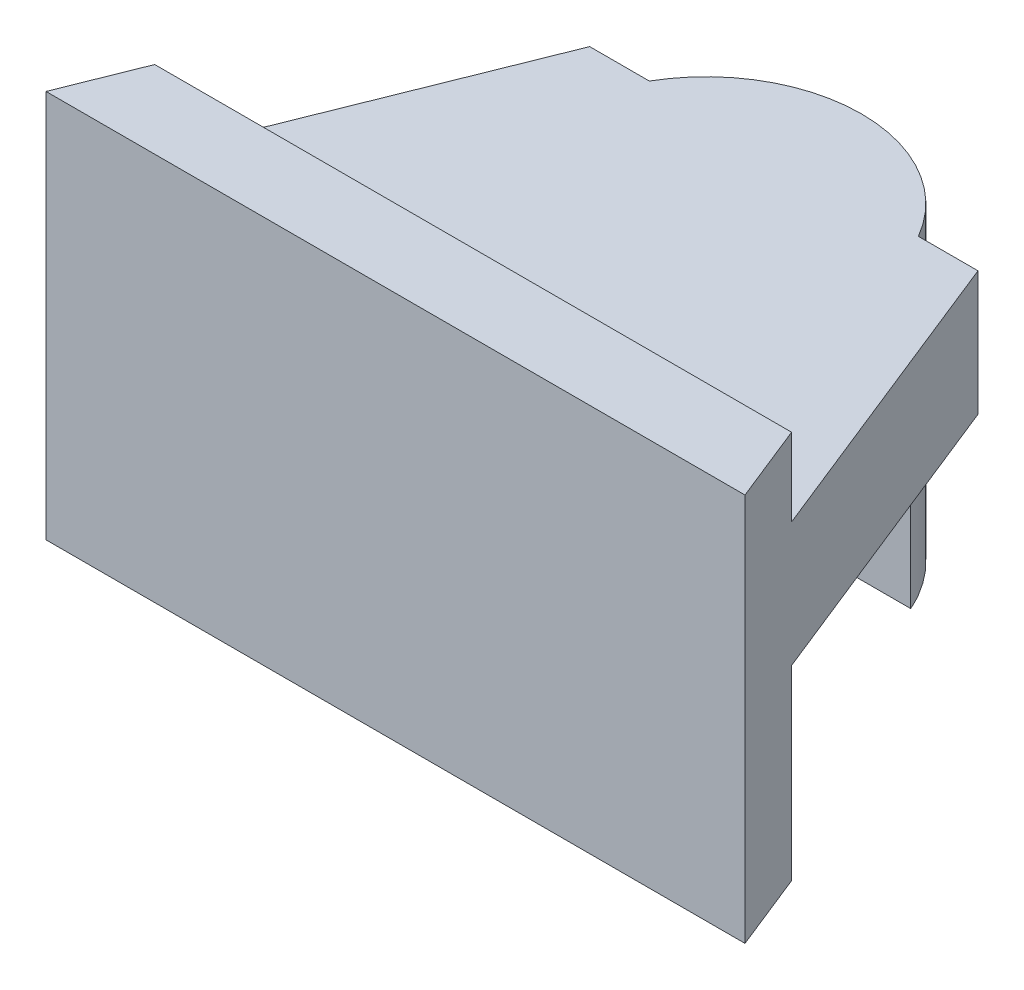
ISO-10303-21;
HEADER;
FILE_DESCRIPTION(('STEP AP214'),'2;1');
FILE_NAME('part.step','',(''),(''),'','','');
FILE_SCHEMA(('AUTOMOTIVE_DESIGN { 1 0 10303 214 1 1 1 1 }'));
ENDSEC;
DATA;
#1=APPLICATION_CONTEXT('core data for automotive mechanical design processes');
#2=APPLICATION_PROTOCOL_DEFINITION('international standard','automotive_design',2000,#1);
#3=PRODUCT_CONTEXT('',#1,'mechanical');
#4=PRODUCT('Part','Part','',(#3));
#5=PRODUCT_RELATED_PRODUCT_CATEGORY('part','',(#4));
#6=PRODUCT_DEFINITION_FORMATION('','',#4);
#7=PRODUCT_DEFINITION_CONTEXT('part definition',#1,'design');
#8=PRODUCT_DEFINITION('design','',#6,#7);
#9=PRODUCT_DEFINITION_SHAPE('','',#8);
#10=(LENGTH_UNIT() NAMED_UNIT(*) SI_UNIT(.MILLI.,.METRE.));
#11=(NAMED_UNIT(*) PLANE_ANGLE_UNIT() SI_UNIT($,.RADIAN.));
#12=(NAMED_UNIT(*) SI_UNIT($,.STERADIAN.) SOLID_ANGLE_UNIT());
#13=UNCERTAINTY_MEASURE_WITH_UNIT(LENGTH_MEASURE(1.E-05),#10,'distance_accuracy_value','');
#14=(GEOMETRIC_REPRESENTATION_CONTEXT(3) GLOBAL_UNCERTAINTY_ASSIGNED_CONTEXT((#13)) GLOBAL_UNIT_ASSIGNED_CONTEXT((#10,
#11,#12)) REPRESENTATION_CONTEXT('',''));
#15=CARTESIAN_POINT('',(0.,0.,0.));
#16=DIRECTION('',(0.,0.,1.));
#17=DIRECTION('',(1.,0.,0.));
#18=AXIS2_PLACEMENT_3D('',#15,#16,#17);
#19=CARTESIAN_POINT('',(0.,0.,0.));
#20=DIRECTION('',(0.,1.,0.));
#21=DIRECTION('',(0.,0.,1.));
#22=AXIS2_PLACEMENT_3D('',#19,#20,#21);
#23=PLANE('',#22);
#24=CARTESIAN_POINT('',(0.,0.,0.));
#25=DIRECTION('',(0.,1.,0.));
#26=DIRECTION('',(0.,0.,1.));
#27=AXIS2_PLACEMENT_3D('',#24,#25,#26);
#28=CIRCLE('',#27,20.);
#29=CARTESIAN_POINT('',(-18.3303027798234,0.,8.));
#30=VERTEX_POINT('',#29);
#31=CARTESIAN_POINT('',(18.3303027798234,0.,8.));
#32=VERTEX_POINT('',#31);
#33=EDGE_CURVE('E191',#30,#32,#28,.T.);
#34=ORIENTED_EDGE('',*,*,#33,.F.);
#35=DIRECTION('',(1.,0.,0.));
#36=VECTOR('',#35,1.);
#37=CARTESIAN_POINT('',(0.,0.,8.));
#38=LINE('',#37,#36);
#39=EDGE_CURVE('E175',#30,#32,#38,.T.);
#40=ORIENTED_EDGE('',*,*,#39,.T.);
#41=EDGE_LOOP('',(#34,#40));
#42=FACE_BOUND('',#41,.T.);
#43=ADVANCED_FACE('F50',(#42),#23,.F.);
#44=CARTESIAN_POINT('',(0.,24.,0.));
#45=DIRECTION('',(0.,-1.,0.));
#46=DIRECTION('',(0.,0.,-1.));
#47=AXIS2_PLACEMENT_3D('',#44,#45,#46);
#48=PLANE('',#47);
#49=DIRECTION('',(0.,0.,1.));
#50=VECTOR('',#49,1.);
#51=CARTESIAN_POINT('',(-6.,24.,0.));
#52=LINE('',#51,#50);
#53=CARTESIAN_POINT('',(-6.,24.,19.0787840283389));
#54=VERTEX_POINT('',#53);
#55=CARTESIAN_POINT('',(-6.,24.,30.));
#56=VERTEX_POINT('',#55);
#57=EDGE_CURVE('E193',#54,#56,#52,.T.);
#58=ORIENTED_EDGE('',*,*,#57,.T.);
#59=DIRECTION('',(-1.,0.,0.));
#60=VECTOR('',#59,1.);
#61=CARTESIAN_POINT('',(0.,24.,30.));
#62=LINE('',#61,#60);
#63=CARTESIAN_POINT('',(-41.,24.,30.));
#64=VERTEX_POINT('',#63);
#65=EDGE_CURVE('E58',#56,#64,#62,.T.);
#66=ORIENTED_EDGE('',*,*,#65,.T.);
#67=DIRECTION('',(-0.371390676354104,0.,0.928476690885259));
#68=VECTOR('',#67,1.);
#69=CARTESIAN_POINT('',(-45.,24.,40.));
#70=LINE('',#69,#68);
#71=CARTESIAN_POINT('',(-25.,24.,-10.));
#72=VERTEX_POINT('',#71);
#73=EDGE_CURVE('E244',#72,#64,#70,.T.);
#74=ORIENTED_EDGE('',*,*,#73,.F.);
#75=DIRECTION('',(-1.,0.,0.));
#76=VECTOR('',#75,1.);
#77=CARTESIAN_POINT('',(-17.3205080756888,24.,-10.));
#78=LINE('',#77,#76);
#79=CARTESIAN_POINT('',(-17.3205080756888,24.,-9.99999999999999));
#80=VERTEX_POINT('',#79);
#81=EDGE_CURVE('E227',#80,#72,#78,.T.);
#82=ORIENTED_EDGE('',*,*,#81,.F.);
#83=CARTESIAN_POINT('',(0.,24.,0.));
#84=DIRECTION('',(0.,-1.,0.));
#85=DIRECTION('',(0.,0.,-1.));
#86=AXIS2_PLACEMENT_3D('',#83,#84,#85);
#87=CIRCLE('',#86,20.);
#88=EDGE_CURVE('E206',#54,#80,#87,.T.);
#89=ORIENTED_EDGE('',*,*,#88,.F.);
#90=EDGE_LOOP('',(#58,#66,#74,#82,#89));
#91=FACE_BOUND('',#90,.T.);
#92=ADVANCED_FACE('F336',(#91),#48,.T.);
#93=CARTESIAN_POINT('',(0.,40.,0.));
#94=DIRECTION('',(0.,1.,0.));
#95=DIRECTION('',(0.,0.,1.));
#96=AXIS2_PLACEMENT_3D('',#93,#94,#95);
#97=PLANE('',#96);
#98=DIRECTION('',(-0.371390676354104,0.,0.928476690885259));
#99=VECTOR('',#98,1.);
#100=CARTESIAN_POINT('',(-45.,40.,40.));
#101=LINE('',#100,#99);
#102=CARTESIAN_POINT('',(-25.,40.,-10.));
#103=VERTEX_POINT('',#102);
#104=CARTESIAN_POINT('',(-41.,40.,30.));
#105=VERTEX_POINT('',#104);
#106=EDGE_CURVE('E233',#103,#105,#101,.T.);
#107=ORIENTED_EDGE('',*,*,#106,.T.);
#108=DIRECTION('',(1.,0.,0.));
#109=VECTOR('',#108,1.);
#110=CARTESIAN_POINT('',(0.,40.,30.));
#111=LINE('',#110,#109);
#112=CARTESIAN_POINT('',(41.,40.,30.));
#113=VERTEX_POINT('',#112);
#114=EDGE_CURVE('E238',#105,#113,#111,.T.);
#115=ORIENTED_EDGE('',*,*,#114,.T.);
#116=DIRECTION('',(-0.371390676354104,0.,-0.928476690885259));
#117=VECTOR('',#116,1.);
#118=CARTESIAN_POINT('',(25.,40.,-10.));
#119=LINE('',#118,#117);
#120=CARTESIAN_POINT('',(25.,40.,-10.));
#121=VERTEX_POINT('',#120);
#122=EDGE_CURVE('E241',#113,#121,#119,.T.);
#123=ORIENTED_EDGE('',*,*,#122,.T.);
#124=DIRECTION('',(-1.,0.,0.));
#125=VECTOR('',#124,1.);
#126=CARTESIAN_POINT('',(-25.,40.,-10.));
#127=LINE('',#126,#125);
#128=CARTESIAN_POINT('',(17.3205080756887,40.,-10.));
#129=VERTEX_POINT('',#128);
#130=EDGE_CURVE('E222',#121,#129,#127,.T.);
#131=ORIENTED_EDGE('',*,*,#130,.T.);
#132=CARTESIAN_POINT('',(0.,40.,0.));
#133=DIRECTION('',(0.,1.,0.));
#134=DIRECTION('',(0.,0.,1.));
#135=AXIS2_PLACEMENT_3D('',#132,#133,#134);
#136=CIRCLE('',#135,20.);
#137=CARTESIAN_POINT('',(-17.3205080756888,40.,-10.));
#138=VERTEX_POINT('',#137);
#139=EDGE_CURVE('E199',#129,#138,#136,.T.);
#140=ORIENTED_EDGE('',*,*,#139,.T.);
#141=EDGE_CURVE('E219',#138,#103,#127,.T.);
#142=ORIENTED_EDGE('',*,*,#141,.T.);
#143=EDGE_LOOP('',(#107,#115,#123,#131,#140,#142));
#144=FACE_BOUND('',#143,.T.);
#145=ADVANCED_FACE('F218',(#144),#97,.T.);
#146=DIRECTION('',(0.,0.,-1.));
#147=VECTOR('',#146,1.);
#148=CARTESIAN_POINT('',(6.,24.,0.));
#149=LINE('',#148,#147);
#150=CARTESIAN_POINT('',(6.,24.,30.));
#151=VERTEX_POINT('',#150);
#152=CARTESIAN_POINT('',(6.,24.,19.0787840283389));
#153=VERTEX_POINT('',#152);
#154=EDGE_CURVE('E264',#151,#153,#149,.T.);
#155=ORIENTED_EDGE('',*,*,#154,.T.);
#156=CARTESIAN_POINT('',(17.3205080756888,24.,-10.));
#157=VERTEX_POINT('',#156);
#158=EDGE_CURVE('E204',#157,#153,#87,.T.);
#159=ORIENTED_EDGE('',*,*,#158,.F.);
#160=CARTESIAN_POINT('',(25.,24.,-10.));
#161=VERTEX_POINT('',#160);
#162=EDGE_CURVE('E231',#161,#157,#78,.T.);
#163=ORIENTED_EDGE('',*,*,#162,.F.);
#164=DIRECTION('',(-0.371390676354104,0.,-0.928476690885259));
#165=VECTOR('',#164,1.);
#166=CARTESIAN_POINT('',(25.,24.,-10.));
#167=LINE('',#166,#165);
#168=CARTESIAN_POINT('',(41.,24.,30.));
#169=VERTEX_POINT('',#168);
#170=EDGE_CURVE('E247',#169,#161,#167,.T.);
#171=ORIENTED_EDGE('',*,*,#170,.F.);
#172=EDGE_CURVE('E13',#169,#151,#62,.T.);
#173=ORIENTED_EDGE('',*,*,#172,.T.);
#174=EDGE_LOOP('',(#155,#159,#163,#171,#173));
#175=FACE_BOUND('',#174,.T.);
#176=ADVANCED_FACE('F263',(#175),#48,.T.);
#177=CARTESIAN_POINT('',(0.,40.,0.));
#178=DIRECTION('',(0.,-1.,0.));
#179=DIRECTION('',(0.,0.,-1.));
#180=AXIS2_PLACEMENT_3D('',#177,#178,#179);
#181=CYLINDRICAL_SURFACE('',#180,20.);
#182=ORIENTED_EDGE('',*,*,#33,.T.);
#183=DIRECTION('',(0.,1.,0.));
#184=VECTOR('',#183,1.);
#185=CARTESIAN_POINT('',(18.3303027798234,0.,8.));
#186=LINE('',#185,#184);
#187=CARTESIAN_POINT('',(18.3303027798234,12.,8.));
#188=VERTEX_POINT('',#187);
#189=EDGE_CURVE('E181',#32,#188,#186,.T.);
#190=ORIENTED_EDGE('',*,*,#189,.T.);
#191=CARTESIAN_POINT('',(0.,12.,0.));
#192=DIRECTION('',(0.,-1.,0.));
#193=DIRECTION('',(0.,0.,-1.));
#194=AXIS2_PLACEMENT_3D('',#191,#192,#193);
#195=CIRCLE('',#194,20.);
#196=CARTESIAN_POINT('',(18.3303027798234,12.,-8.));
#197=VERTEX_POINT('',#196);
#198=EDGE_CURVE('E186',#188,#197,#195,.F.);
#199=ORIENTED_EDGE('',*,*,#198,.T.);
#200=DIRECTION('',(0.,1.,0.));
#201=VECTOR('',#200,1.);
#202=CARTESIAN_POINT('',(18.3303027798234,0.,-8.));
#203=LINE('',#202,#201);
#204=CARTESIAN_POINT('',(18.3303027798234,0.,-8.));
#205=VERTEX_POINT('',#204);
#206=EDGE_CURVE('E348',#205,#197,#203,.T.);
#207=ORIENTED_EDGE('',*,*,#206,.F.);
#208=CARTESIAN_POINT('',(-18.3303027798234,0.,-8.));
#209=VERTEX_POINT('',#208);
#210=EDGE_CURVE('E195',#205,#209,#28,.T.);
#211=ORIENTED_EDGE('',*,*,#210,.T.);
#212=DIRECTION('',(0.,1.,0.));
#213=VECTOR('',#212,1.);
#214=CARTESIAN_POINT('',(-18.3303027798234,0.,-8.));
#215=LINE('',#214,#213);
#216=CARTESIAN_POINT('',(-18.3303027798234,12.,-8.));
#217=VERTEX_POINT('',#216);
#218=EDGE_CURVE('E65',#209,#217,#215,.T.);
#219=ORIENTED_EDGE('',*,*,#218,.T.);
#220=CARTESIAN_POINT('',(-18.3303027798234,12.,8.));
#221=VERTEX_POINT('',#220);
#222=EDGE_CURVE('E192',#217,#221,#195,.F.);
#223=ORIENTED_EDGE('',*,*,#222,.T.);
#224=DIRECTION('',(0.,1.,0.));
#225=VECTOR('',#224,1.);
#226=CARTESIAN_POINT('',(-18.3303027798234,0.,8.));
#227=LINE('',#226,#225);
#228=EDGE_CURVE('E178',#30,#221,#227,.T.);
#229=ORIENTED_EDGE('',*,*,#228,.F.);
#230=EDGE_LOOP('',(#182,#190,#199,#207,#211,#219,#223,#229));
#231=FACE_BOUND('',#230,.T.);
#232=CARTESIAN_POINT('',(0.,3.99999999999999,0.));
#233=DIRECTION('',(0.,-1.,0.));
#234=DIRECTION('',(0.,0.,-1.));
#235=AXIS2_PLACEMENT_3D('',#232,#233,#234);
#236=CIRCLE('',#235,20.);
#237=CARTESIAN_POINT('',(-6.,3.99999999999999,19.0787840283389));
#238=VERTEX_POINT('',#237);
#239=CARTESIAN_POINT('',(6.,3.99999999999999,19.0787840283389));
#240=VERTEX_POINT('',#239);
#241=EDGE_CURVE('E270',#238,#240,#236,.F.);
#242=ORIENTED_EDGE('',*,*,#241,.F.);
#243=DIRECTION('',(0.,1.,0.));
#244=VECTOR('',#243,1.);
#245=CARTESIAN_POINT('',(-6.,3.99999999999999,19.0787840283389));
#246=LINE('',#245,#244);
#247=EDGE_CURVE('E283',#238,#54,#246,.T.);
#248=ORIENTED_EDGE('',*,*,#247,.T.);
#249=ORIENTED_EDGE('',*,*,#88,.T.);
#250=DIRECTION('',(0.,-1.,0.));
#251=VECTOR('',#250,1.);
#252=CARTESIAN_POINT('',(-17.3205080756888,40.,-10.));
#253=LINE('',#252,#251);
#254=EDGE_CURVE('E196',#138,#80,#253,.T.);
#255=ORIENTED_EDGE('',*,*,#254,.F.);
#256=ORIENTED_EDGE('',*,*,#139,.F.);
#257=DIRECTION('',(0.,-1.,0.));
#258=VECTOR('',#257,1.);
#259=CARTESIAN_POINT('',(17.3205080756888,40.,-10.));
#260=LINE('',#259,#258);
#261=EDGE_CURVE('E201',#157,#129,#260,.F.);
#262=ORIENTED_EDGE('',*,*,#261,.F.);
#263=ORIENTED_EDGE('',*,*,#158,.T.);
#264=DIRECTION('',(0.,1.,0.));
#265=VECTOR('',#264,1.);
#266=CARTESIAN_POINT('',(6.,3.99999999999999,19.0787840283389));
#267=LINE('',#266,#265);
#268=EDGE_CURVE('E281',#240,#153,#267,.T.);
#269=ORIENTED_EDGE('',*,*,#268,.F.);
#270=EDGE_LOOP('',(#242,#248,#249,#255,#256,#262,#263,#269));
#271=FACE_BOUND('',#270,.T.);
#272=ADVANCED_FACE('F52',(#231,#271),#181,.T.);
#273=ORIENTED_EDGE('',*,*,#210,.F.);
#274=DIRECTION('',(-1.,0.,0.));
#275=VECTOR('',#274,1.);
#276=CARTESIAN_POINT('',(0.,0.,-8.));
#277=LINE('',#276,#275);
#278=EDGE_CURVE('E185',#205,#209,#277,.T.);
#279=ORIENTED_EDGE('',*,*,#278,.T.);
#280=EDGE_LOOP('',(#273,#279));
#281=FACE_BOUND('',#280,.T.);
#282=ADVANCED_FACE('F358',(#281),#23,.F.);
#283=CARTESIAN_POINT('',(-17.3205080756888,40.,-10.));
#284=DIRECTION('',(0.,0.,1.));
#285=DIRECTION('',(1.,0.,0.));
#286=AXIS2_PLACEMENT_3D('',#283,#284,#285);
#287=PLANE('',#286);
#288=ORIENTED_EDGE('',*,*,#141,.F.);
#289=ORIENTED_EDGE('',*,*,#254,.T.);
#290=ORIENTED_EDGE('',*,*,#81,.T.);
#291=DIRECTION('',(0.,-1.,0.));
#292=VECTOR('',#291,1.);
#293=CARTESIAN_POINT('',(-25.,40.,-10.));
#294=LINE('',#293,#292);
#295=EDGE_CURVE('E230',#103,#72,#294,.T.);
#296=ORIENTED_EDGE('',*,*,#295,.F.);
#297=EDGE_LOOP('',(#288,#289,#290,#296));
#298=FACE_BOUND('',#297,.T.);
#299=ADVANCED_FACE('F225',(#298),#287,.F.);
#300=ORIENTED_EDGE('',*,*,#162,.T.);
#301=ORIENTED_EDGE('',*,*,#261,.T.);
#302=ORIENTED_EDGE('',*,*,#130,.F.);
#303=DIRECTION('',(0.,-1.,0.));
#304=VECTOR('',#303,1.);
#305=CARTESIAN_POINT('',(25.,40.,-10.));
#306=LINE('',#305,#304);
#307=EDGE_CURVE('E243',#121,#161,#306,.T.);
#308=ORIENTED_EDGE('',*,*,#307,.T.);
#309=EDGE_LOOP('',(#300,#301,#302,#308));
#310=FACE_BOUND('',#309,.T.);
#311=ADVANCED_FACE('F257',(#310),#287,.F.);
#312=CARTESIAN_POINT('',(-45.,40.,40.));
#313=DIRECTION('',(0.92847669088526,0.,0.371390676354104));
#314=DIRECTION('',(0.371390676354104,0.,-0.928476690885259));
#315=AXIS2_PLACEMENT_3D('',#312,#313,#314);
#316=PLANE('',#315);
#317=DIRECTION('',(0.,-1.,0.));
#318=VECTOR('',#317,1.);
#319=CARTESIAN_POINT('',(-45.,40.,40.));
#320=LINE('',#319,#318);
#321=CARTESIAN_POINT('',(-45.,50.,40.));
#322=VERTEX_POINT('',#321);
#323=CARTESIAN_POINT('',(-45.,0.,40.));
#324=VERTEX_POINT('',#323);
#325=EDGE_CURVE('E253',#322,#324,#320,.T.);
#326=ORIENTED_EDGE('',*,*,#325,.F.);
#327=DIRECTION('',(0.371390676354103,0.,-0.92847669088526));
#328=VECTOR('',#327,1.);
#329=CARTESIAN_POINT('',(-41.,50.,30.));
#330=LINE('',#329,#328);
#331=CARTESIAN_POINT('',(-41.,50.,30.));
#332=VERTEX_POINT('',#331);
#333=EDGE_CURVE('E303',#322,#332,#330,.T.);
#334=ORIENTED_EDGE('',*,*,#333,.T.);
#335=DIRECTION('',(0.,1.,0.));
#336=VECTOR('',#335,1.);
#337=CARTESIAN_POINT('',(-41.,0.,30.));
#338=LINE('',#337,#336);
#339=EDGE_CURVE('E310',#105,#332,#338,.T.);
#340=ORIENTED_EDGE('',*,*,#339,.F.);
#341=ORIENTED_EDGE('',*,*,#106,.F.);
#342=ORIENTED_EDGE('',*,*,#295,.T.);
#343=ORIENTED_EDGE('',*,*,#73,.T.);
#344=CARTESIAN_POINT('',(-41.,0.,30.));
#345=VERTEX_POINT('',#344);
#346=EDGE_CURVE('E311',#345,#64,#338,.T.);
#347=ORIENTED_EDGE('',*,*,#346,.F.);
#348=DIRECTION('',(0.371390676354103,0.,-0.92847669088526));
#349=VECTOR('',#348,1.);
#350=CARTESIAN_POINT('',(-41.,0.,30.));
#351=LINE('',#350,#349);
#352=EDGE_CURVE('E293',#324,#345,#351,.T.);
#353=ORIENTED_EDGE('',*,*,#352,.F.);
#354=EDGE_LOOP('',(#326,#334,#340,#341,#342,#343,#347,#353));
#355=FACE_BOUND('',#354,.T.);
#356=ADVANCED_FACE('F325',(#355),#316,.F.);
#357=CARTESIAN_POINT('',(45.,40.,40.));
#358=DIRECTION('',(0.,0.,-1.));
#359=DIRECTION('',(-1.,0.,0.));
#360=AXIS2_PLACEMENT_3D('',#357,#358,#359);
#361=PLANE('',#360);
#362=ORIENTED_EDGE('',*,*,#325,.T.);
#363=DIRECTION('',(-1.,0.,0.));
#364=VECTOR('',#363,1.);
#365=CARTESIAN_POINT('',(-45.,0.,40.));
#366=LINE('',#365,#364);
#367=CARTESIAN_POINT('',(45.,0.,40.));
#368=VERTEX_POINT('',#367);
#369=EDGE_CURVE('E289',#368,#324,#366,.T.);
#370=ORIENTED_EDGE('',*,*,#369,.F.);
#371=DIRECTION('',(0.,-1.,0.));
#372=VECTOR('',#371,1.);
#373=CARTESIAN_POINT('',(45.,40.,40.));
#374=LINE('',#373,#372);
#375=CARTESIAN_POINT('',(45.,50.,40.));
#376=VERTEX_POINT('',#375);
#377=EDGE_CURVE('E251',#376,#368,#374,.T.);
#378=ORIENTED_EDGE('',*,*,#377,.F.);
#379=DIRECTION('',(-1.,0.,0.));
#380=VECTOR('',#379,1.);
#381=CARTESIAN_POINT('',(-45.,50.,40.));
#382=LINE('',#381,#380);
#383=EDGE_CURVE('E300',#376,#322,#382,.T.);
#384=ORIENTED_EDGE('',*,*,#383,.T.);
#385=EDGE_LOOP('',(#362,#370,#378,#384));
#386=FACE_BOUND('',#385,.T.);
#387=ADVANCED_FACE('F396',(#386),#361,.F.);
#388=CARTESIAN_POINT('',(25.,40.,-10.));
#389=DIRECTION('',(-0.928476690885259,0.,0.371390676354104));
#390=DIRECTION('',(0.371390676354104,0.,0.928476690885259));
#391=AXIS2_PLACEMENT_3D('',#388,#389,#390);
#392=PLANE('',#391);
#393=ORIENTED_EDGE('',*,*,#377,.T.);
#394=DIRECTION('',(0.371390676354104,0.,0.928476690885259));
#395=VECTOR('',#394,1.);
#396=CARTESIAN_POINT('',(45.,0.,40.));
#397=LINE('',#396,#395);
#398=CARTESIAN_POINT('',(41.,0.,30.));
#399=VERTEX_POINT('',#398);
#400=EDGE_CURVE('E286',#399,#368,#397,.T.);
#401=ORIENTED_EDGE('',*,*,#400,.F.);
#402=DIRECTION('',(0.,1.,0.));
#403=VECTOR('',#402,1.);
#404=CARTESIAN_POINT('',(41.,0.,30.));
#405=LINE('',#404,#403);
#406=EDGE_CURVE('E308',#399,#169,#405,.T.);
#407=ORIENTED_EDGE('',*,*,#406,.T.);
#408=ORIENTED_EDGE('',*,*,#170,.T.);
#409=ORIENTED_EDGE('',*,*,#307,.F.);
#410=ORIENTED_EDGE('',*,*,#122,.F.);
#411=CARTESIAN_POINT('',(41.,50.,30.));
#412=VERTEX_POINT('',#411);
#413=EDGE_CURVE('E297',#113,#412,#405,.T.);
#414=ORIENTED_EDGE('',*,*,#413,.T.);
#415=DIRECTION('',(0.371390676354104,0.,0.928476690885259));
#416=VECTOR('',#415,1.);
#417=CARTESIAN_POINT('',(45.,50.,40.));
#418=LINE('',#417,#416);
#419=EDGE_CURVE('E285',#412,#376,#418,.T.);
#420=ORIENTED_EDGE('',*,*,#419,.T.);
#421=EDGE_LOOP('',(#393,#401,#407,#408,#409,#410,#414,#420));
#422=FACE_BOUND('',#421,.T.);
#423=ADVANCED_FACE('F331',(#422),#392,.F.);
#424=CARTESIAN_POINT('',(0.,0.,0.));
#425=DIRECTION('',(0.,1.,0.));
#426=DIRECTION('',(0.,0.,1.));
#427=AXIS2_PLACEMENT_3D('',#424,#425,#426);
#428=PLANE('',#427);
#429=ORIENTED_EDGE('',*,*,#400,.T.);
#430=ORIENTED_EDGE('',*,*,#369,.T.);
#431=ORIENTED_EDGE('',*,*,#352,.T.);
#432=DIRECTION('',(1.,0.,0.));
#433=VECTOR('',#432,1.);
#434=CARTESIAN_POINT('',(41.,0.,30.));
#435=LINE('',#434,#433);
#436=EDGE_CURVE('E295',#345,#399,#435,.T.);
#437=ORIENTED_EDGE('',*,*,#436,.T.);
#438=EDGE_LOOP('',(#429,#430,#431,#437));
#439=FACE_BOUND('',#438,.T.);
#440=ADVANCED_FACE('F395',(#439),#428,.F.);
#441=CARTESIAN_POINT('',(41.,0.,30.));
#442=DIRECTION('',(0.,0.,1.));
#443=DIRECTION('',(1.,0.,0.));
#444=AXIS2_PLACEMENT_3D('',#441,#442,#443);
#445=PLANE('',#444);
#446=ORIENTED_EDGE('',*,*,#65,.F.);
#447=DIRECTION('',(0.,1.,0.));
#448=VECTOR('',#447,1.);
#449=CARTESIAN_POINT('',(-6.,3.99999999999999,30.));
#450=LINE('',#449,#448);
#451=CARTESIAN_POINT('',(-6.,3.99999999999999,30.));
#452=VERTEX_POINT('',#451);
#453=EDGE_CURVE('E276',#452,#56,#450,.T.);
#454=ORIENTED_EDGE('',*,*,#453,.F.);
#455=DIRECTION('',(-1.,0.,0.));
#456=VECTOR('',#455,1.);
#457=CARTESIAN_POINT('',(0.,3.99999999999999,30.));
#458=LINE('',#457,#456);
#459=CARTESIAN_POINT('',(6.,3.99999999999999,30.));
#460=VERTEX_POINT('',#459);
#461=EDGE_CURVE('E279',#460,#452,#458,.T.);
#462=ORIENTED_EDGE('',*,*,#461,.F.);
#463=DIRECTION('',(0.,1.,0.));
#464=VECTOR('',#463,1.);
#465=CARTESIAN_POINT('',(6.,3.99999999999999,30.));
#466=LINE('',#465,#464);
#467=EDGE_CURVE('E278',#460,#151,#466,.T.);
#468=ORIENTED_EDGE('',*,*,#467,.T.);
#469=ORIENTED_EDGE('',*,*,#172,.F.);
#470=ORIENTED_EDGE('',*,*,#406,.F.);
#471=ORIENTED_EDGE('',*,*,#436,.F.);
#472=ORIENTED_EDGE('',*,*,#346,.T.);
#473=EDGE_LOOP('',(#446,#454,#462,#468,#469,#470,#471,#472));
#474=FACE_BOUND('',#473,.T.);
#475=ADVANCED_FACE('F338',(#474),#445,.F.);
#476=ORIENTED_EDGE('',*,*,#114,.F.);
#477=ORIENTED_EDGE('',*,*,#339,.T.);
#478=DIRECTION('',(1.,0.,0.));
#479=VECTOR('',#478,1.);
#480=CARTESIAN_POINT('',(41.,50.,30.));
#481=LINE('',#480,#479);
#482=EDGE_CURVE('E290',#332,#412,#481,.T.);
#483=ORIENTED_EDGE('',*,*,#482,.T.);
#484=ORIENTED_EDGE('',*,*,#413,.F.);
#485=EDGE_LOOP('',(#476,#477,#483,#484));
#486=FACE_BOUND('',#485,.T.);
#487=ADVANCED_FACE('F320',(#486),#445,.F.);
#488=CARTESIAN_POINT('',(0.,50.,0.));
#489=DIRECTION('',(0.,1.,0.));
#490=DIRECTION('',(0.,0.,1.));
#491=AXIS2_PLACEMENT_3D('',#488,#489,#490);
#492=PLANE('',#491);
#493=ORIENTED_EDGE('',*,*,#419,.F.);
#494=ORIENTED_EDGE('',*,*,#482,.F.);
#495=ORIENTED_EDGE('',*,*,#333,.F.);
#496=ORIENTED_EDGE('',*,*,#383,.F.);
#497=EDGE_LOOP('',(#493,#494,#495,#496));
#498=FACE_BOUND('',#497,.T.);
#499=ADVANCED_FACE('F329',(#498),#492,.T.);
#500=CARTESIAN_POINT('',(-6.,3.99999999999999,0.));
#501=DIRECTION('',(-1.,0.,0.));
#502=DIRECTION('',(0.,0.,1.));
#503=AXIS2_PLACEMENT_3D('',#500,#501,#502);
#504=PLANE('',#503);
#505=ORIENTED_EDGE('',*,*,#57,.F.);
#506=ORIENTED_EDGE('',*,*,#247,.F.);
#507=DIRECTION('',(0.,0.,1.));
#508=VECTOR('',#507,1.);
#509=CARTESIAN_POINT('',(-6.,3.99999999999999,0.));
#510=LINE('',#509,#508);
#511=EDGE_CURVE('E267',#238,#452,#510,.T.);
#512=ORIENTED_EDGE('',*,*,#511,.T.);
#513=ORIENTED_EDGE('',*,*,#453,.T.);
#514=EDGE_LOOP('',(#505,#506,#512,#513));
#515=FACE_BOUND('',#514,.T.);
#516=ADVANCED_FACE('F341',(#515),#504,.T.);
#517=CARTESIAN_POINT('',(6.,3.99999999999999,0.));
#518=DIRECTION('',(1.,0.,0.));
#519=DIRECTION('',(0.,0.,-1.));
#520=AXIS2_PLACEMENT_3D('',#517,#518,#519);
#521=PLANE('',#520);
#522=ORIENTED_EDGE('',*,*,#154,.F.);
#523=ORIENTED_EDGE('',*,*,#467,.F.);
#524=DIRECTION('',(0.,0.,-1.));
#525=VECTOR('',#524,1.);
#526=CARTESIAN_POINT('',(6.,3.99999999999999,0.));
#527=LINE('',#526,#525);
#528=EDGE_CURVE('E73',#460,#240,#527,.T.);
#529=ORIENTED_EDGE('',*,*,#528,.T.);
#530=ORIENTED_EDGE('',*,*,#268,.T.);
#531=EDGE_LOOP('',(#522,#523,#529,#530));
#532=FACE_BOUND('',#531,.T.);
#533=ADVANCED_FACE('F502',(#532),#521,.T.);
#534=CARTESIAN_POINT('',(0.,3.99999999999999,0.));
#535=DIRECTION('',(0.,-1.,0.));
#536=DIRECTION('',(0.,0.,-1.));
#537=AXIS2_PLACEMENT_3D('',#534,#535,#536);
#538=PLANE('',#537);
#539=ORIENTED_EDGE('',*,*,#511,.F.);
#540=ORIENTED_EDGE('',*,*,#241,.T.);
#541=ORIENTED_EDGE('',*,*,#528,.F.);
#542=ORIENTED_EDGE('',*,*,#461,.T.);
#543=EDGE_LOOP('',(#539,#540,#541,#542));
#544=FACE_BOUND('',#543,.T.);
#545=ADVANCED_FACE('F343',(#544),#538,.T.);
#546=CARTESIAN_POINT('',(0.,0.,8.));
#547=DIRECTION('',(0.,0.,1.));
#548=DIRECTION('',(1.,0.,0.));
#549=AXIS2_PLACEMENT_3D('',#546,#547,#548);
#550=PLANE('',#549);
#551=DIRECTION('',(1.,0.,0.));
#552=VECTOR('',#551,1.);
#553=CARTESIAN_POINT('',(0.,12.,8.));
#554=LINE('',#553,#552);
#555=EDGE_CURVE('E354',#221,#188,#554,.T.);
#556=ORIENTED_EDGE('',*,*,#555,.T.);
#557=ORIENTED_EDGE('',*,*,#189,.F.);
#558=ORIENTED_EDGE('',*,*,#39,.F.);
#559=ORIENTED_EDGE('',*,*,#228,.T.);
#560=EDGE_LOOP('',(#556,#557,#558,#559));
#561=FACE_BOUND('',#560,.T.);
#562=ADVANCED_FACE('F177',(#561),#550,.F.);
#563=CARTESIAN_POINT('',(0.,0.,-8.));
#564=DIRECTION('',(0.,0.,-1.));
#565=DIRECTION('',(-1.,0.,0.));
#566=AXIS2_PLACEMENT_3D('',#563,#564,#565);
#567=PLANE('',#566);
#568=DIRECTION('',(-1.,0.,0.));
#569=VECTOR('',#568,1.);
#570=CARTESIAN_POINT('',(0.,12.,-8.));
#571=LINE('',#570,#569);
#572=EDGE_CURVE('E351',#197,#217,#571,.T.);
#573=ORIENTED_EDGE('',*,*,#572,.T.);
#574=ORIENTED_EDGE('',*,*,#218,.F.);
#575=ORIENTED_EDGE('',*,*,#278,.F.);
#576=ORIENTED_EDGE('',*,*,#206,.T.);
#577=EDGE_LOOP('',(#573,#574,#575,#576));
#578=FACE_BOUND('',#577,.T.);
#579=ADVANCED_FACE('F363',(#578),#567,.F.);
#580=CARTESIAN_POINT('',(0.,12.,0.));
#581=DIRECTION('',(0.,-1.,0.));
#582=DIRECTION('',(0.,0.,-1.));
#583=AXIS2_PLACEMENT_3D('',#580,#581,#582);
#584=PLANE('',#583);
#585=ORIENTED_EDGE('',*,*,#555,.F.);
#586=ORIENTED_EDGE('',*,*,#222,.F.);
#587=ORIENTED_EDGE('',*,*,#572,.F.);
#588=ORIENTED_EDGE('',*,*,#198,.F.);
#589=EDGE_LOOP('',(#585,#586,#587,#588));
#590=FACE_BOUND('',#589,.T.);
#591=ADVANCED_FACE('F365',(#590),#584,.T.);
#592=CLOSED_SHELL('',(#43,#92,#145,#176,#272,#282,#299,#311,#356,#387,#423,#440,#475,#487,#499,
#516,#533,#545,#562,#579,#591));
#593=MANIFOLD_SOLID_BREP('B2',#592);
#594=ADVANCED_BREP_SHAPE_REPRESENTATION('',(#18,#593),#14);
#595=SHAPE_DEFINITION_REPRESENTATION(#9,#594);
ENDSEC;
END-ISO-10303-21;
